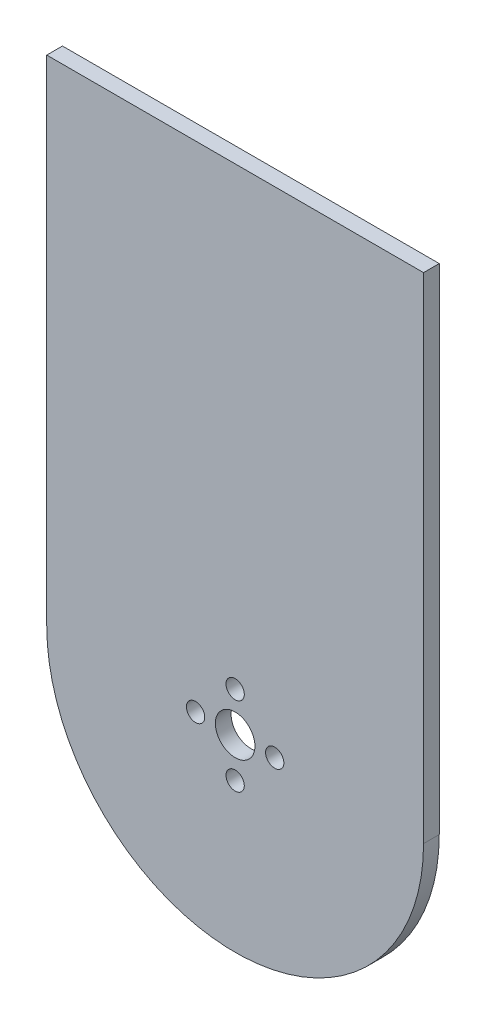
ISO-10303-21;
HEADER;
FILE_DESCRIPTION(('STEP AP214'),'2;1');
FILE_NAME('part.step','',(''),(''),'','','');
FILE_SCHEMA(('AUTOMOTIVE_DESIGN { 1 0 10303 214 1 1 1 1 }'));
ENDSEC;
DATA;
#1=APPLICATION_CONTEXT('core data for automotive mechanical design processes');
#2=APPLICATION_PROTOCOL_DEFINITION('international standard','automotive_design',2000,#1);
#3=PRODUCT_CONTEXT('',#1,'mechanical');
#4=PRODUCT('Part','Part','',(#3));
#5=PRODUCT_RELATED_PRODUCT_CATEGORY('part','',(#4));
#6=PRODUCT_DEFINITION_FORMATION('','',#4);
#7=PRODUCT_DEFINITION_CONTEXT('part definition',#1,'design');
#8=PRODUCT_DEFINITION('design','',#6,#7);
#9=PRODUCT_DEFINITION_SHAPE('','',#8);
#10=(LENGTH_UNIT() NAMED_UNIT(*) SI_UNIT(.MILLI.,.METRE.));
#11=(NAMED_UNIT(*) PLANE_ANGLE_UNIT() SI_UNIT($,.RADIAN.));
#12=(NAMED_UNIT(*) SI_UNIT($,.STERADIAN.) SOLID_ANGLE_UNIT());
#13=UNCERTAINTY_MEASURE_WITH_UNIT(LENGTH_MEASURE(1.E-05),#10,'distance_accuracy_value','');
#14=(GEOMETRIC_REPRESENTATION_CONTEXT(3) GLOBAL_UNCERTAINTY_ASSIGNED_CONTEXT((#13)) GLOBAL_UNIT_ASSIGNED_CONTEXT((#10,
#11,#12)) REPRESENTATION_CONTEXT('',''));
#15=CARTESIAN_POINT('',(0.,0.,0.));
#16=DIRECTION('',(0.,0.,1.));
#17=DIRECTION('',(1.,0.,0.));
#18=AXIS2_PLACEMENT_3D('',#15,#16,#17);
#19=CARTESIAN_POINT('',(0.,0.,3.175));
#20=DIRECTION('',(0.,0.,1.));
#21=DIRECTION('',(1.,0.,0.));
#22=AXIS2_PLACEMENT_3D('',#19,#20,#21);
#23=PLANE('',#22);
#24=CARTESIAN_POINT('',(0.,8.,3.175));
#25=DIRECTION('',(0.,0.,1.));
#26=DIRECTION('',(1.,0.,0.));
#27=AXIS2_PLACEMENT_3D('',#24,#25,#26);
#28=CIRCLE('',#27,1.85);
#29=CARTESIAN_POINT('',(1.85,8.,3.175));
#30=VERTEX_POINT('',#29);
#31=EDGE_CURVE('E128',#30,#30,#28,.T.);
#32=ORIENTED_EDGE('',*,*,#31,.F.);
#33=EDGE_LOOP('',(#32));
#34=FACE_BOUND('',#33,.T.);
#35=CARTESIAN_POINT('',(-8.,0.,3.175));
#36=DIRECTION('',(0.,0.,1.));
#37=DIRECTION('',(1.,0.,0.));
#38=AXIS2_PLACEMENT_3D('',#35,#36,#37);
#39=CIRCLE('',#38,1.85);
#40=CARTESIAN_POINT('',(-6.15,0.,3.175));
#41=VERTEX_POINT('',#40);
#42=EDGE_CURVE('E116',#41,#41,#39,.T.);
#43=ORIENTED_EDGE('',*,*,#42,.F.);
#44=EDGE_LOOP('',(#43));
#45=FACE_BOUND('',#44,.T.);
#46=DIRECTION('',(0.,-1.,0.));
#47=VECTOR('',#46,1.);
#48=CARTESIAN_POINT('',(-38.1,100.,3.175));
#49=LINE('',#48,#47);
#50=CARTESIAN_POINT('',(-38.1,100.,3.175));
#51=VERTEX_POINT('',#50);
#52=CARTESIAN_POINT('',(-38.1,0.,3.175));
#53=VERTEX_POINT('',#52);
#54=EDGE_CURVE('E86',#51,#53,#49,.T.);
#55=ORIENTED_EDGE('',*,*,#54,.T.);
#56=CARTESIAN_POINT('',(0.,0.,3.175));
#57=DIRECTION('',(0.,0.,1.));
#58=DIRECTION('',(1.,0.,0.));
#59=AXIS2_PLACEMENT_3D('',#56,#57,#58);
#60=CIRCLE('',#59,38.1);
#61=CARTESIAN_POINT('',(38.1,0.,3.175));
#62=VERTEX_POINT('',#61);
#63=EDGE_CURVE('E81',#53,#62,#60,.T.);
#64=ORIENTED_EDGE('',*,*,#63,.T.);
#65=DIRECTION('',(0.,1.,0.));
#66=VECTOR('',#65,1.);
#67=CARTESIAN_POINT('',(38.1,100.,3.175));
#68=LINE('',#67,#66);
#69=CARTESIAN_POINT('',(38.1,100.,3.175));
#70=VERTEX_POINT('',#69);
#71=EDGE_CURVE('E84',#62,#70,#68,.T.);
#72=ORIENTED_EDGE('',*,*,#71,.T.);
#73=DIRECTION('',(-1.,0.,0.));
#74=VECTOR('',#73,1.);
#75=CARTESIAN_POINT('',(-38.1,100.,3.175));
#76=LINE('',#75,#74);
#77=EDGE_CURVE('E51',#70,#51,#76,.T.);
#78=ORIENTED_EDGE('',*,*,#77,.T.);
#79=EDGE_LOOP('',(#55,#64,#72,#78));
#80=FACE_BOUND('',#79,.T.);
#81=CARTESIAN_POINT('',(0.,0.,3.175));
#82=DIRECTION('',(0.,0.,1.));
#83=DIRECTION('',(1.,0.,0.));
#84=AXIS2_PLACEMENT_3D('',#81,#82,#83);
#85=CIRCLE('',#84,4.);
#86=CARTESIAN_POINT('',(4.00000000000001,0.,3.175));
#87=VERTEX_POINT('',#86);
#88=EDGE_CURVE('E101',#87,#87,#85,.T.);
#89=ORIENTED_EDGE('',*,*,#88,.F.);
#90=EDGE_LOOP('',(#89));
#91=FACE_BOUND('',#90,.T.);
#92=CARTESIAN_POINT('',(0.,-8.,3.175));
#93=DIRECTION('',(0.,0.,1.));
#94=DIRECTION('',(1.,0.,0.));
#95=AXIS2_PLACEMENT_3D('',#92,#93,#94);
#96=CIRCLE('',#95,1.85);
#97=CARTESIAN_POINT('',(1.85,-8.,3.175));
#98=VERTEX_POINT('',#97);
#99=EDGE_CURVE('E122',#98,#98,#96,.T.);
#100=ORIENTED_EDGE('',*,*,#99,.F.);
#101=EDGE_LOOP('',(#100));
#102=FACE_BOUND('',#101,.T.);
#103=CARTESIAN_POINT('',(8.,0.,3.175));
#104=DIRECTION('',(0.,0.,1.));
#105=DIRECTION('',(1.,0.,0.));
#106=AXIS2_PLACEMENT_3D('',#103,#104,#105);
#107=CIRCLE('',#106,1.85);
#108=CARTESIAN_POINT('',(9.85,0.,3.175));
#109=VERTEX_POINT('',#108);
#110=EDGE_CURVE('E134',#109,#109,#107,.T.);
#111=ORIENTED_EDGE('',*,*,#110,.F.);
#112=EDGE_LOOP('',(#111));
#113=FACE_BOUND('',#112,.T.);
#114=ADVANCED_FACE('F34',(#34,#45,#80,#91,#102,#113),#23,.T.);
#115=CARTESIAN_POINT('',(0.,0.,0.));
#116=DIRECTION('',(0.,0.,1.));
#117=DIRECTION('',(1.,0.,0.));
#118=AXIS2_PLACEMENT_3D('',#115,#116,#117);
#119=PLANE('',#118);
#120=DIRECTION('',(0.,-1.,0.));
#121=VECTOR('',#120,1.);
#122=CARTESIAN_POINT('',(-38.1,100.,0.));
#123=LINE('',#122,#121);
#124=CARTESIAN_POINT('',(-38.1,100.,0.));
#125=VERTEX_POINT('',#124);
#126=CARTESIAN_POINT('',(-38.1,0.,0.));
#127=VERTEX_POINT('',#126);
#128=EDGE_CURVE('E98',#125,#127,#123,.T.);
#129=ORIENTED_EDGE('',*,*,#128,.F.);
#130=DIRECTION('',(-1.,0.,0.));
#131=VECTOR('',#130,1.);
#132=CARTESIAN_POINT('',(-38.1,100.,0.));
#133=LINE('',#132,#131);
#134=CARTESIAN_POINT('',(38.1,100.,0.));
#135=VERTEX_POINT('',#134);
#136=EDGE_CURVE('E74',#135,#125,#133,.T.);
#137=ORIENTED_EDGE('',*,*,#136,.F.);
#138=DIRECTION('',(0.,1.,0.));
#139=VECTOR('',#138,1.);
#140=CARTESIAN_POINT('',(38.1,100.,0.));
#141=LINE('',#140,#139);
#142=CARTESIAN_POINT('',(38.1,0.,0.));
#143=VERTEX_POINT('',#142);
#144=EDGE_CURVE('E68',#143,#135,#141,.T.);
#145=ORIENTED_EDGE('',*,*,#144,.F.);
#146=CARTESIAN_POINT('',(0.,0.,0.));
#147=DIRECTION('',(0.,0.,1.));
#148=DIRECTION('',(1.,0.,0.));
#149=AXIS2_PLACEMENT_3D('',#146,#147,#148);
#150=CIRCLE('',#149,38.1);
#151=EDGE_CURVE('E90',#127,#143,#150,.T.);
#152=ORIENTED_EDGE('',*,*,#151,.F.);
#153=EDGE_LOOP('',(#129,#137,#145,#152));
#154=FACE_BOUND('',#153,.T.);
#155=CARTESIAN_POINT('',(0.,0.,0.));
#156=DIRECTION('',(0.,0.,1.));
#157=DIRECTION('',(1.,0.,0.));
#158=AXIS2_PLACEMENT_3D('',#155,#156,#157);
#159=CIRCLE('',#158,4.);
#160=CARTESIAN_POINT('',(4.00000000000001,0.,0.));
#161=VERTEX_POINT('',#160);
#162=EDGE_CURVE('E113',#161,#161,#159,.T.);
#163=ORIENTED_EDGE('',*,*,#162,.T.);
#164=EDGE_LOOP('',(#163));
#165=FACE_BOUND('',#164,.T.);
#166=CARTESIAN_POINT('',(-8.,0.,0.));
#167=DIRECTION('',(0.,0.,1.));
#168=DIRECTION('',(1.,0.,0.));
#169=AXIS2_PLACEMENT_3D('',#166,#167,#168);
#170=CIRCLE('',#169,1.85);
#171=CARTESIAN_POINT('',(-6.15,0.,0.));
#172=VERTEX_POINT('',#171);
#173=EDGE_CURVE('E119',#172,#172,#170,.T.);
#174=ORIENTED_EDGE('',*,*,#173,.T.);
#175=EDGE_LOOP('',(#174));
#176=FACE_BOUND('',#175,.T.);
#177=CARTESIAN_POINT('',(0.,-8.,0.));
#178=DIRECTION('',(0.,0.,1.));
#179=DIRECTION('',(1.,0.,0.));
#180=AXIS2_PLACEMENT_3D('',#177,#178,#179);
#181=CIRCLE('',#180,1.85);
#182=CARTESIAN_POINT('',(1.85,-8.,0.));
#183=VERTEX_POINT('',#182);
#184=EDGE_CURVE('E125',#183,#183,#181,.T.);
#185=ORIENTED_EDGE('',*,*,#184,.T.);
#186=EDGE_LOOP('',(#185));
#187=FACE_BOUND('',#186,.T.);
#188=CARTESIAN_POINT('',(0.,8.,0.));
#189=DIRECTION('',(0.,0.,1.));
#190=DIRECTION('',(1.,0.,0.));
#191=AXIS2_PLACEMENT_3D('',#188,#189,#190);
#192=CIRCLE('',#191,1.85);
#193=CARTESIAN_POINT('',(1.85,8.,0.));
#194=VERTEX_POINT('',#193);
#195=EDGE_CURVE('E131',#194,#194,#192,.T.);
#196=ORIENTED_EDGE('',*,*,#195,.T.);
#197=EDGE_LOOP('',(#196));
#198=FACE_BOUND('',#197,.T.);
#199=CARTESIAN_POINT('',(8.,0.,0.));
#200=DIRECTION('',(0.,0.,1.));
#201=DIRECTION('',(1.,0.,0.));
#202=AXIS2_PLACEMENT_3D('',#199,#200,#201);
#203=CIRCLE('',#202,1.85);
#204=CARTESIAN_POINT('',(9.85,0.,0.));
#205=VERTEX_POINT('',#204);
#206=EDGE_CURVE('E137',#205,#205,#203,.T.);
#207=ORIENTED_EDGE('',*,*,#206,.T.);
#208=EDGE_LOOP('',(#207));
#209=FACE_BOUND('',#208,.T.);
#210=ADVANCED_FACE('F109',(#154,#165,#176,#187,#198,#209),#119,.F.);
#211=CARTESIAN_POINT('',(-38.1,100.,3.175));
#212=DIRECTION('',(1.,0.,0.));
#213=DIRECTION('',(0.,1.,0.));
#214=AXIS2_PLACEMENT_3D('',#211,#212,#213);
#215=PLANE('',#214);
#216=ORIENTED_EDGE('',*,*,#128,.T.);
#217=DIRECTION('',(0.,0.,-1.));
#218=VECTOR('',#217,1.);
#219=CARTESIAN_POINT('',(-38.1,0.,3.175));
#220=LINE('',#219,#218);
#221=EDGE_CURVE('E11',#53,#127,#220,.T.);
#222=ORIENTED_EDGE('',*,*,#221,.F.);
#223=ORIENTED_EDGE('',*,*,#54,.F.);
#224=DIRECTION('',(0.,0.,-1.));
#225=VECTOR('',#224,1.);
#226=CARTESIAN_POINT('',(-38.1,100.,3.175));
#227=LINE('',#226,#225);
#228=EDGE_CURVE('E94',#51,#125,#227,.T.);
#229=ORIENTED_EDGE('',*,*,#228,.T.);
#230=EDGE_LOOP('',(#216,#222,#223,#229));
#231=FACE_BOUND('',#230,.T.);
#232=ADVANCED_FACE('F36',(#231),#215,.F.);
#233=CARTESIAN_POINT('',(0.,0.,3.175));
#234=DIRECTION('',(0.,0.,-1.));
#235=DIRECTION('',(-1.,0.,0.));
#236=AXIS2_PLACEMENT_3D('',#233,#234,#235);
#237=CYLINDRICAL_SURFACE('',#236,38.1);
#238=ORIENTED_EDGE('',*,*,#151,.T.);
#239=DIRECTION('',(0.,0.,-1.));
#240=VECTOR('',#239,1.);
#241=CARTESIAN_POINT('',(38.1,0.,3.175));
#242=LINE('',#241,#240);
#243=EDGE_CURVE('E43',#62,#143,#242,.T.);
#244=ORIENTED_EDGE('',*,*,#243,.F.);
#245=ORIENTED_EDGE('',*,*,#63,.F.);
#246=ORIENTED_EDGE('',*,*,#221,.T.);
#247=EDGE_LOOP('',(#238,#244,#245,#246));
#248=FACE_BOUND('',#247,.T.);
#249=ADVANCED_FACE('F89',(#248),#237,.T.);
#250=CARTESIAN_POINT('',(38.1,100.,3.175));
#251=DIRECTION('',(-1.,0.,0.));
#252=DIRECTION('',(0.,-1.,0.));
#253=AXIS2_PLACEMENT_3D('',#250,#251,#252);
#254=PLANE('',#253);
#255=ORIENTED_EDGE('',*,*,#144,.T.);
#256=DIRECTION('',(0.,0.,-1.));
#257=VECTOR('',#256,1.);
#258=CARTESIAN_POINT('',(38.1,100.,3.175));
#259=LINE('',#258,#257);
#260=EDGE_CURVE('E91',#70,#135,#259,.T.);
#261=ORIENTED_EDGE('',*,*,#260,.F.);
#262=ORIENTED_EDGE('',*,*,#71,.F.);
#263=ORIENTED_EDGE('',*,*,#243,.T.);
#264=EDGE_LOOP('',(#255,#261,#262,#263));
#265=FACE_BOUND('',#264,.T.);
#266=ADVANCED_FACE('F92',(#265),#254,.F.);
#267=CARTESIAN_POINT('',(-38.1,100.,3.175));
#268=DIRECTION('',(0.,-1.,0.));
#269=DIRECTION('',(0.,0.,-1.));
#270=AXIS2_PLACEMENT_3D('',#267,#268,#269);
#271=PLANE('',#270);
#272=ORIENTED_EDGE('',*,*,#136,.T.);
#273=ORIENTED_EDGE('',*,*,#228,.F.);
#274=ORIENTED_EDGE('',*,*,#77,.F.);
#275=ORIENTED_EDGE('',*,*,#260,.T.);
#276=EDGE_LOOP('',(#272,#273,#274,#275));
#277=FACE_BOUND('',#276,.T.);
#278=ADVANCED_FACE('F106',(#277),#271,.F.);
#279=CARTESIAN_POINT('',(0.,0.,3.175));
#280=DIRECTION('',(0.,0.,-1.));
#281=DIRECTION('',(-1.,0.,0.));
#282=AXIS2_PLACEMENT_3D('',#279,#280,#281);
#283=CYLINDRICAL_SURFACE('',#282,4.);
#284=ORIENTED_EDGE('',*,*,#88,.T.);
#285=EDGE_LOOP('',(#284));
#286=FACE_BOUND('',#285,.T.);
#287=ORIENTED_EDGE('',*,*,#162,.F.);
#288=EDGE_LOOP('',(#287));
#289=FACE_BOUND('',#288,.T.);
#290=ADVANCED_FACE('F156',(#286,#289),#283,.F.);
#291=CARTESIAN_POINT('',(-8.,0.,3.175));
#292=DIRECTION('',(0.,0.,-1.));
#293=DIRECTION('',(-1.,0.,0.));
#294=AXIS2_PLACEMENT_3D('',#291,#292,#293);
#295=CYLINDRICAL_SURFACE('',#294,1.85);
#296=ORIENTED_EDGE('',*,*,#42,.T.);
#297=EDGE_LOOP('',(#296));
#298=FACE_BOUND('',#297,.T.);
#299=ORIENTED_EDGE('',*,*,#173,.F.);
#300=EDGE_LOOP('',(#299));
#301=FACE_BOUND('',#300,.T.);
#302=ADVANCED_FACE('F202',(#298,#301),#295,.F.);
#303=CARTESIAN_POINT('',(0.,-8.,3.175));
#304=DIRECTION('',(0.,0.,-1.));
#305=DIRECTION('',(-1.,0.,0.));
#306=AXIS2_PLACEMENT_3D('',#303,#304,#305);
#307=CYLINDRICAL_SURFACE('',#306,1.85);
#308=ORIENTED_EDGE('',*,*,#99,.T.);
#309=EDGE_LOOP('',(#308));
#310=FACE_BOUND('',#309,.T.);
#311=ORIENTED_EDGE('',*,*,#184,.F.);
#312=EDGE_LOOP('',(#311));
#313=FACE_BOUND('',#312,.T.);
#314=ADVANCED_FACE('F210',(#310,#313),#307,.F.);
#315=CARTESIAN_POINT('',(0.,8.,3.175));
#316=DIRECTION('',(0.,0.,-1.));
#317=DIRECTION('',(-1.,0.,0.));
#318=AXIS2_PLACEMENT_3D('',#315,#316,#317);
#319=CYLINDRICAL_SURFACE('',#318,1.85);
#320=ORIENTED_EDGE('',*,*,#31,.T.);
#321=EDGE_LOOP('',(#320));
#322=FACE_BOUND('',#321,.T.);
#323=ORIENTED_EDGE('',*,*,#195,.F.);
#324=EDGE_LOOP('',(#323));
#325=FACE_BOUND('',#324,.T.);
#326=ADVANCED_FACE('F218',(#322,#325),#319,.F.);
#327=CARTESIAN_POINT('',(8.,0.,3.175));
#328=DIRECTION('',(0.,0.,-1.));
#329=DIRECTION('',(-1.,0.,0.));
#330=AXIS2_PLACEMENT_3D('',#327,#328,#329);
#331=CYLINDRICAL_SURFACE('',#330,1.85);
#332=ORIENTED_EDGE('',*,*,#110,.T.);
#333=EDGE_LOOP('',(#332));
#334=FACE_BOUND('',#333,.T.);
#335=ORIENTED_EDGE('',*,*,#206,.F.);
#336=EDGE_LOOP('',(#335));
#337=FACE_BOUND('',#336,.T.);
#338=ADVANCED_FACE('F143',(#334,#337),#331,.F.);
#339=CLOSED_SHELL('',(#114,#210,#232,#249,#266,#278,#290,#302,#314,#326,#338));
#340=MANIFOLD_SOLID_BREP('B2',#339);
#341=ADVANCED_BREP_SHAPE_REPRESENTATION('',(#18,#340),#14);
#342=SHAPE_DEFINITION_REPRESENTATION(#9,#341);
ENDSEC;
END-ISO-10303-21;
